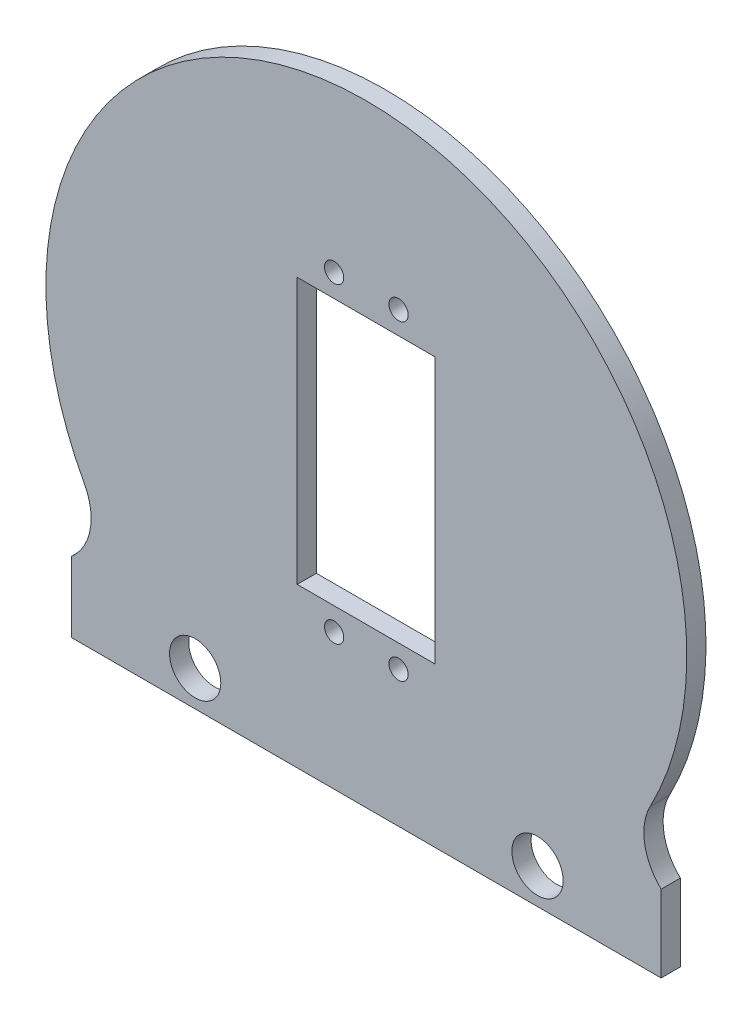
ISO-10303-21;
HEADER;
FILE_DESCRIPTION(('STEP AP214'),'2;1');
FILE_NAME('part.step','',(''),(''),'','','');
FILE_SCHEMA(('AUTOMOTIVE_DESIGN { 1 0 10303 214 1 1 1 1 }'));
ENDSEC;
DATA;
#1=APPLICATION_CONTEXT('core data for automotive mechanical design processes');
#2=APPLICATION_PROTOCOL_DEFINITION('international standard','automotive_design',2000,#1);
#3=PRODUCT_CONTEXT('',#1,'mechanical');
#4=PRODUCT('Part','Part','',(#3));
#5=PRODUCT_RELATED_PRODUCT_CATEGORY('part','',(#4));
#6=PRODUCT_DEFINITION_FORMATION('','',#4);
#7=PRODUCT_DEFINITION_CONTEXT('part definition',#1,'design');
#8=PRODUCT_DEFINITION('design','',#6,#7);
#9=PRODUCT_DEFINITION_SHAPE('','',#8);
#10=(LENGTH_UNIT() NAMED_UNIT(*) SI_UNIT(.MILLI.,.METRE.));
#11=(NAMED_UNIT(*) PLANE_ANGLE_UNIT() SI_UNIT($,.RADIAN.));
#12=(NAMED_UNIT(*) SI_UNIT($,.STERADIAN.) SOLID_ANGLE_UNIT());
#13=UNCERTAINTY_MEASURE_WITH_UNIT(LENGTH_MEASURE(1.E-05),#10,'distance_accuracy_value','');
#14=(GEOMETRIC_REPRESENTATION_CONTEXT(3) GLOBAL_UNCERTAINTY_ASSIGNED_CONTEXT((#13)) GLOBAL_UNIT_ASSIGNED_CONTEXT((#10,
#11,#12)) REPRESENTATION_CONTEXT('',''));
#15=CARTESIAN_POINT('',(0.,0.,0.));
#16=DIRECTION('',(0.,0.,1.));
#17=DIRECTION('',(1.,0.,0.));
#18=AXIS2_PLACEMENT_3D('',#15,#16,#17);
#19=CARTESIAN_POINT('',(52.025716267414,-27.2340343584031,3.));
#20=DIRECTION('',(0.,0.,1.));
#21=DIRECTION('',(1.,0.,0.));
#22=AXIS2_PLACEMENT_3D('',#19,#20,#21);
#23=PLANE('',#22);
#24=CARTESIAN_POINT('',(-26.7100000000002,-40.0437872606226,3.));
#25=DIRECTION('',(0.,0.,1.));
#26=DIRECTION('',(1.,0.,0.));
#27=AXIS2_PLACEMENT_3D('',#24,#25,#26);
#28=CIRCLE('',#27,4.);
#29=CARTESIAN_POINT('',(-22.7100000000002,-40.0437872606226,3.));
#30=VERTEX_POINT('',#29);
#31=EDGE_CURVE('E287',#30,#30,#28,.T.);
#32=ORIENTED_EDGE('',*,*,#31,.F.);
#33=EDGE_LOOP('',(#32));
#34=FACE_BOUND('',#33,.T.);
#35=CARTESIAN_POINT('',(-5.025,-24.3,3.));
#36=DIRECTION('',(0.,0.,1.));
#37=DIRECTION('',(-1.,0.,0.));
#38=AXIS2_PLACEMENT_3D('',#35,#36,#37);
#39=CIRCLE('',#38,1.5);
#40=CARTESIAN_POINT('',(-6.525,-24.3,3.));
#41=VERTEX_POINT('',#40);
#42=EDGE_CURVE('E299',#41,#41,#39,.T.);
#43=ORIENTED_EDGE('',*,*,#42,.F.);
#44=EDGE_LOOP('',(#43));
#45=FACE_BOUND('',#44,.T.);
#46=CARTESIAN_POINT('',(5.02499999999999,24.3,3.));
#47=DIRECTION('',(0.,0.,1.));
#48=DIRECTION('',(-1.,0.,0.));
#49=AXIS2_PLACEMENT_3D('',#46,#47,#48);
#50=CIRCLE('',#49,1.5);
#51=CARTESIAN_POINT('',(3.52499999999999,24.3,3.));
#52=VERTEX_POINT('',#51);
#53=EDGE_CURVE('E145',#52,#52,#50,.T.);
#54=ORIENTED_EDGE('',*,*,#53,.F.);
#55=EDGE_LOOP('',(#54));
#56=FACE_BOUND('',#55,.T.);
#57=DIRECTION('',(1.,0.,0.));
#58=VECTOR('',#57,1.);
#59=CARTESIAN_POINT('',(-46.,-45.5410196624969,3.));
#60=LINE('',#59,#58);
#61=CARTESIAN_POINT('',(-46.,-45.5410196624969,3.));
#62=VERTEX_POINT('',#61);
#63=CARTESIAN_POINT('',(46.,-45.5410196624969,3.));
#64=VERTEX_POINT('',#63);
#65=EDGE_CURVE('E155',#62,#64,#60,.T.);
#66=ORIENTED_EDGE('',*,*,#65,.T.);
#67=DIRECTION('',(0.,1.,0.));
#68=VECTOR('',#67,1.);
#69=CARTESIAN_POINT('',(46.,-33.5410196624969,3.));
#70=LINE('',#69,#68);
#71=CARTESIAN_POINT('',(46.,-33.5410196624969,3.));
#72=VERTEX_POINT('',#71);
#73=EDGE_CURVE('E158',#64,#72,#70,.T.);
#74=ORIENTED_EDGE('',*,*,#73,.T.);
#75=CARTESIAN_POINT('',(52.025716267414,-27.2340343584031,3.));
#76=DIRECTION('',(0.,0.,-1.));
#77=DIRECTION('',(1.,0.,0.));
#78=AXIS2_PLACEMENT_3D('',#75,#76,#77);
#79=CIRCLE('',#78,8.72280460410714);
#80=CARTESIAN_POINT('',(44.2977107600335,-23.1886356092896,3.));
#81=VERTEX_POINT('',#80);
#82=EDGE_CURVE('E161',#72,#81,#79,.T.);
#83=ORIENTED_EDGE('',*,*,#82,.T.);
#84=CARTESIAN_POINT('',(0.,0.,3.));
#85=DIRECTION('',(0.,0.,1.));
#86=DIRECTION('',(1.,0.,0.));
#87=AXIS2_PLACEMENT_3D('',#84,#85,#86);
#88=CIRCLE('',#87,50.);
#89=CARTESIAN_POINT('',(-43.9901379219059,-23.7669469139748,3.));
#90=VERTEX_POINT('',#89);
#91=EDGE_CURVE('E163',#81,#90,#88,.T.);
#92=ORIENTED_EDGE('',*,*,#91,.T.);
#93=CARTESIAN_POINT('',(-51.6644854739161,-27.9132355933105,3.));
#94=DIRECTION('',(0.,0.,-1.));
#95=DIRECTION('',(-1.,0.,0.));
#96=AXIS2_PLACEMENT_3D('',#93,#94,#95);
#97=CIRCLE('',#96,8.72280460410715);
#98=CARTESIAN_POINT('',(-46.,-34.5465548587482,3.));
#99=VERTEX_POINT('',#98);
#100=EDGE_CURVE('E165',#90,#99,#97,.T.);
#101=ORIENTED_EDGE('',*,*,#100,.T.);
#102=DIRECTION('',(0.,-1.,0.));
#103=VECTOR('',#102,1.);
#104=CARTESIAN_POINT('',(-46.,-34.5465548587482,3.));
#105=LINE('',#104,#103);
#106=EDGE_CURVE('E167',#99,#62,#105,.T.);
#107=ORIENTED_EDGE('',*,*,#106,.T.);
#108=EDGE_LOOP('',(#66,#74,#83,#92,#101,#107));
#109=FACE_BOUND('',#108,.T.);
#110=DIRECTION('',(-1.,0.,0.));
#111=VECTOR('',#110,1.);
#112=CARTESIAN_POINT('',(-10.7948280140151,20.75,3.));
#113=LINE('',#112,#111);
#114=CARTESIAN_POINT('',(10.7051719859849,20.75,3.));
#115=VERTEX_POINT('',#114);
#116=CARTESIAN_POINT('',(-10.7948280140151,20.75,3.));
#117=VERTEX_POINT('',#116);
#118=EDGE_CURVE('E124',#115,#117,#113,.T.);
#119=ORIENTED_EDGE('',*,*,#118,.F.);
#120=DIRECTION('',(0.,1.,0.));
#121=VECTOR('',#120,1.);
#122=CARTESIAN_POINT('',(10.7051719859849,20.75,3.));
#123=LINE('',#122,#121);
#124=CARTESIAN_POINT('',(10.7051719859849,-20.75,3.));
#125=VERTEX_POINT('',#124);
#126=EDGE_CURVE('E116',#125,#115,#123,.T.);
#127=ORIENTED_EDGE('',*,*,#126,.F.);
#128=DIRECTION('',(1.,0.,0.));
#129=VECTOR('',#128,1.);
#130=CARTESIAN_POINT('',(-10.7948280140151,-20.75,3.));
#131=LINE('',#130,#129);
#132=CARTESIAN_POINT('',(-10.7948280140151,-20.75,3.));
#133=VERTEX_POINT('',#132);
#134=EDGE_CURVE('E139',#133,#125,#131,.T.);
#135=ORIENTED_EDGE('',*,*,#134,.F.);
#136=DIRECTION('',(0.,-1.,0.));
#137=VECTOR('',#136,1.);
#138=CARTESIAN_POINT('',(-10.7948280140151,20.75,3.));
#139=LINE('',#138,#137);
#140=EDGE_CURVE('E137',#117,#133,#139,.T.);
#141=ORIENTED_EDGE('',*,*,#140,.F.);
#142=EDGE_LOOP('',(#119,#127,#135,#141));
#143=FACE_BOUND('',#142,.T.);
#144=CARTESIAN_POINT('',(5.025,-24.3,3.));
#145=DIRECTION('',(0.,0.,1.));
#146=DIRECTION('',(-1.,0.,0.));
#147=AXIS2_PLACEMENT_3D('',#144,#145,#146);
#148=CIRCLE('',#147,1.5);
#149=CARTESIAN_POINT('',(3.525,-24.3,3.));
#150=VERTEX_POINT('',#149);
#151=EDGE_CURVE('E305',#150,#150,#148,.T.);
#152=ORIENTED_EDGE('',*,*,#151,.F.);
#153=EDGE_LOOP('',(#152));
#154=FACE_BOUND('',#153,.T.);
#155=CARTESIAN_POINT('',(-5.02500000000001,24.3,3.));
#156=DIRECTION('',(0.,0.,1.));
#157=DIRECTION('',(-1.,0.,0.));
#158=AXIS2_PLACEMENT_3D('',#155,#156,#157);
#159=CIRCLE('',#158,1.5);
#160=CARTESIAN_POINT('',(-6.52500000000001,24.3,3.));
#161=VERTEX_POINT('',#160);
#162=EDGE_CURVE('E293',#161,#161,#159,.T.);
#163=ORIENTED_EDGE('',*,*,#162,.F.);
#164=EDGE_LOOP('',(#163));
#165=FACE_BOUND('',#164,.T.);
#166=CARTESIAN_POINT('',(26.7100000000002,-40.0437872606226,3.));
#167=DIRECTION('',(0.,0.,1.));
#168=DIRECTION('',(-1.,0.,0.));
#169=AXIS2_PLACEMENT_3D('',#166,#167,#168);
#170=CIRCLE('',#169,3.99999999999999);
#171=CARTESIAN_POINT('',(22.7100000000002,-40.0437872606226,3.));
#172=VERTEX_POINT('',#171);
#173=EDGE_CURVE('E278',#172,#172,#170,.T.);
#174=ORIENTED_EDGE('',*,*,#173,.F.);
#175=EDGE_LOOP('',(#174));
#176=FACE_BOUND('',#175,.T.);
#177=ADVANCED_FACE('F39',(#34,#45,#56,#109,#143,#154,#165,#176),#23,.T.);
#178=CARTESIAN_POINT('',(52.025716267414,-27.2340343584031,0.));
#179=DIRECTION('',(0.,0.,1.));
#180=DIRECTION('',(1.,0.,0.));
#181=AXIS2_PLACEMENT_3D('',#178,#179,#180);
#182=PLANE('',#181);
#183=DIRECTION('',(1.,0.,0.));
#184=VECTOR('',#183,1.);
#185=CARTESIAN_POINT('',(-46.,-45.5410196624969,0.));
#186=LINE('',#185,#184);
#187=CARTESIAN_POINT('',(-46.,-45.5410196624969,0.));
#188=VERTEX_POINT('',#187);
#189=CARTESIAN_POINT('',(46.,-45.5410196624969,0.));
#190=VERTEX_POINT('',#189);
#191=EDGE_CURVE('E132',#188,#190,#186,.T.);
#192=ORIENTED_EDGE('',*,*,#191,.F.);
#193=DIRECTION('',(0.,-1.,0.));
#194=VECTOR('',#193,1.);
#195=CARTESIAN_POINT('',(-46.,-34.5465548587482,0.));
#196=LINE('',#195,#194);
#197=CARTESIAN_POINT('',(-46.,-34.5465548587482,0.));
#198=VERTEX_POINT('',#197);
#199=EDGE_CURVE('E159',#198,#188,#196,.T.);
#200=ORIENTED_EDGE('',*,*,#199,.F.);
#201=CARTESIAN_POINT('',(-51.6644854739161,-27.9132355933105,0.));
#202=DIRECTION('',(0.,0.,-1.));
#203=DIRECTION('',(-1.,0.,0.));
#204=AXIS2_PLACEMENT_3D('',#201,#202,#203);
#205=CIRCLE('',#204,8.72280460410715);
#206=CARTESIAN_POINT('',(-43.9901379219059,-23.7669469139748,0.));
#207=VERTEX_POINT('',#206);
#208=EDGE_CURVE('E178',#207,#198,#205,.T.);
#209=ORIENTED_EDGE('',*,*,#208,.F.);
#210=CARTESIAN_POINT('',(0.,0.,0.));
#211=DIRECTION('',(0.,0.,1.));
#212=DIRECTION('',(1.,0.,0.));
#213=AXIS2_PLACEMENT_3D('',#210,#211,#212);
#214=CIRCLE('',#213,50.);
#215=CARTESIAN_POINT('',(44.2977107600335,-23.1886356092896,0.));
#216=VERTEX_POINT('',#215);
#217=EDGE_CURVE('E176',#216,#207,#214,.T.);
#218=ORIENTED_EDGE('',*,*,#217,.F.);
#219=CARTESIAN_POINT('',(52.025716267414,-27.2340343584031,0.));
#220=DIRECTION('',(0.,0.,-1.));
#221=DIRECTION('',(1.,0.,0.));
#222=AXIS2_PLACEMENT_3D('',#219,#220,#221);
#223=CIRCLE('',#222,8.72280460410714);
#224=CARTESIAN_POINT('',(46.,-33.5410196624969,0.));
#225=VERTEX_POINT('',#224);
#226=EDGE_CURVE('E174',#225,#216,#223,.T.);
#227=ORIENTED_EDGE('',*,*,#226,.F.);
#228=DIRECTION('',(0.,1.,0.));
#229=VECTOR('',#228,1.);
#230=CARTESIAN_POINT('',(46.,-33.5410196624969,0.));
#231=LINE('',#230,#229);
#232=EDGE_CURVE('E172',#190,#225,#231,.T.);
#233=ORIENTED_EDGE('',*,*,#232,.F.);
#234=EDGE_LOOP('',(#192,#200,#209,#218,#227,#233));
#235=FACE_BOUND('',#234,.T.);
#236=DIRECTION('',(0.,1.,0.));
#237=VECTOR('',#236,1.);
#238=CARTESIAN_POINT('',(10.7051719859849,20.75,0.));
#239=LINE('',#238,#237);
#240=CARTESIAN_POINT('',(10.7051719859849,-20.75,0.));
#241=VERTEX_POINT('',#240);
#242=CARTESIAN_POINT('',(10.7051719859849,20.75,0.));
#243=VERTEX_POINT('',#242);
#244=EDGE_CURVE('E62',#241,#243,#239,.T.);
#245=ORIENTED_EDGE('',*,*,#244,.T.);
#246=DIRECTION('',(-1.,0.,0.));
#247=VECTOR('',#246,1.);
#248=CARTESIAN_POINT('',(-10.7948280140151,20.75,0.));
#249=LINE('',#248,#247);
#250=CARTESIAN_POINT('',(-10.7948280140151,20.75,0.));
#251=VERTEX_POINT('',#250);
#252=EDGE_CURVE('E131',#243,#251,#249,.T.);
#253=ORIENTED_EDGE('',*,*,#252,.T.);
#254=DIRECTION('',(0.,-1.,0.));
#255=VECTOR('',#254,1.);
#256=CARTESIAN_POINT('',(-10.7948280140151,20.75,0.));
#257=LINE('',#256,#255);
#258=CARTESIAN_POINT('',(-10.7948280140151,-20.75,0.));
#259=VERTEX_POINT('',#258);
#260=EDGE_CURVE('E147',#251,#259,#257,.T.);
#261=ORIENTED_EDGE('',*,*,#260,.T.);
#262=DIRECTION('',(1.,0.,0.));
#263=VECTOR('',#262,1.);
#264=CARTESIAN_POINT('',(-10.7948280140151,-20.75,0.));
#265=LINE('',#264,#263);
#266=EDGE_CURVE('E125',#259,#241,#265,.T.);
#267=ORIENTED_EDGE('',*,*,#266,.T.);
#268=EDGE_LOOP('',(#245,#253,#261,#267));
#269=FACE_BOUND('',#268,.T.);
#270=CARTESIAN_POINT('',(5.02499999999999,24.3,0.));
#271=DIRECTION('',(0.,0.,1.));
#272=DIRECTION('',(-1.,0.,0.));
#273=AXIS2_PLACEMENT_3D('',#270,#271,#272);
#274=CIRCLE('',#273,1.5);
#275=CARTESIAN_POINT('',(3.52499999999999,24.3,0.));
#276=VERTEX_POINT('',#275);
#277=EDGE_CURVE('E308',#276,#276,#274,.T.);
#278=ORIENTED_EDGE('',*,*,#277,.T.);
#279=EDGE_LOOP('',(#278));
#280=FACE_BOUND('',#279,.T.);
#281=CARTESIAN_POINT('',(5.025,-24.3,0.));
#282=DIRECTION('',(0.,0.,1.));
#283=DIRECTION('',(-1.,0.,0.));
#284=AXIS2_PLACEMENT_3D('',#281,#282,#283);
#285=CIRCLE('',#284,1.5);
#286=CARTESIAN_POINT('',(3.525,-24.3,0.));
#287=VERTEX_POINT('',#286);
#288=EDGE_CURVE('E302',#287,#287,#285,.T.);
#289=ORIENTED_EDGE('',*,*,#288,.T.);
#290=EDGE_LOOP('',(#289));
#291=FACE_BOUND('',#290,.T.);
#292=CARTESIAN_POINT('',(-5.025,-24.3,0.));
#293=DIRECTION('',(0.,0.,1.));
#294=DIRECTION('',(-1.,0.,0.));
#295=AXIS2_PLACEMENT_3D('',#292,#293,#294);
#296=CIRCLE('',#295,1.5);
#297=CARTESIAN_POINT('',(-6.525,-24.3,0.));
#298=VERTEX_POINT('',#297);
#299=EDGE_CURVE('E296',#298,#298,#296,.T.);
#300=ORIENTED_EDGE('',*,*,#299,.T.);
#301=EDGE_LOOP('',(#300));
#302=FACE_BOUND('',#301,.T.);
#303=CARTESIAN_POINT('',(-5.02500000000001,24.3,0.));
#304=DIRECTION('',(0.,0.,1.));
#305=DIRECTION('',(-1.,0.,0.));
#306=AXIS2_PLACEMENT_3D('',#303,#304,#305);
#307=CIRCLE('',#306,1.5);
#308=CARTESIAN_POINT('',(-6.52500000000001,24.3,0.));
#309=VERTEX_POINT('',#308);
#310=EDGE_CURVE('E290',#309,#309,#307,.T.);
#311=ORIENTED_EDGE('',*,*,#310,.T.);
#312=EDGE_LOOP('',(#311));
#313=FACE_BOUND('',#312,.T.);
#314=CARTESIAN_POINT('',(-26.7100000000002,-40.0437872606226,0.));
#315=DIRECTION('',(0.,0.,1.));
#316=DIRECTION('',(1.,0.,0.));
#317=AXIS2_PLACEMENT_3D('',#314,#315,#316);
#318=CIRCLE('',#317,4.);
#319=CARTESIAN_POINT('',(-22.7100000000002,-40.0437872606226,0.));
#320=VERTEX_POINT('',#319);
#321=EDGE_CURVE('E284',#320,#320,#318,.T.);
#322=ORIENTED_EDGE('',*,*,#321,.T.);
#323=EDGE_LOOP('',(#322));
#324=FACE_BOUND('',#323,.T.);
#325=CARTESIAN_POINT('',(26.7100000000002,-40.0437872606226,0.));
#326=DIRECTION('',(0.,0.,1.));
#327=DIRECTION('',(-1.,0.,0.));
#328=AXIS2_PLACEMENT_3D('',#325,#326,#327);
#329=CIRCLE('',#328,3.99999999999999);
#330=CARTESIAN_POINT('',(22.7100000000002,-40.0437872606226,0.));
#331=VERTEX_POINT('',#330);
#332=EDGE_CURVE('E281',#331,#331,#329,.T.);
#333=ORIENTED_EDGE('',*,*,#332,.T.);
#334=EDGE_LOOP('',(#333));
#335=FACE_BOUND('',#334,.T.);
#336=ADVANCED_FACE('F202',(#235,#269,#280,#291,#302,#313,#324,#335),#182,.F.);
#337=CARTESIAN_POINT('',(-46.,-45.5410196624969,3.));
#338=DIRECTION('',(0.,1.,0.));
#339=DIRECTION('',(0.,0.,1.));
#340=AXIS2_PLACEMENT_3D('',#337,#338,#339);
#341=PLANE('',#340);
#342=ORIENTED_EDGE('',*,*,#191,.T.);
#343=DIRECTION('',(0.,0.,-1.));
#344=VECTOR('',#343,1.);
#345=CARTESIAN_POINT('',(46.,-45.5410196624969,3.));
#346=LINE('',#345,#344);
#347=EDGE_CURVE('E11',#64,#190,#346,.T.);
#348=ORIENTED_EDGE('',*,*,#347,.F.);
#349=ORIENTED_EDGE('',*,*,#65,.F.);
#350=DIRECTION('',(0.,0.,-1.));
#351=VECTOR('',#350,1.);
#352=CARTESIAN_POINT('',(-46.,-45.5410196624969,3.));
#353=LINE('',#352,#351);
#354=EDGE_CURVE('E169',#62,#188,#353,.T.);
#355=ORIENTED_EDGE('',*,*,#354,.T.);
#356=EDGE_LOOP('',(#342,#348,#349,#355));
#357=FACE_BOUND('',#356,.T.);
#358=ADVANCED_FACE('F41',(#357),#341,.F.);
#359=CARTESIAN_POINT('',(46.,-33.5410196624969,3.));
#360=DIRECTION('',(-1.,0.,0.));
#361=DIRECTION('',(0.,0.,1.));
#362=AXIS2_PLACEMENT_3D('',#359,#360,#361);
#363=PLANE('',#362);
#364=ORIENTED_EDGE('',*,*,#232,.T.);
#365=DIRECTION('',(0.,0.,-1.));
#366=VECTOR('',#365,1.);
#367=CARTESIAN_POINT('',(46.,-33.5410196624969,3.));
#368=LINE('',#367,#366);
#369=EDGE_CURVE('E47',#72,#225,#368,.T.);
#370=ORIENTED_EDGE('',*,*,#369,.F.);
#371=ORIENTED_EDGE('',*,*,#73,.F.);
#372=ORIENTED_EDGE('',*,*,#347,.T.);
#373=EDGE_LOOP('',(#364,#370,#371,#372));
#374=FACE_BOUND('',#373,.T.);
#375=ADVANCED_FACE('F219',(#374),#363,.F.);
#376=CARTESIAN_POINT('',(52.025716267414,-27.2340343584031,3.));
#377=DIRECTION('',(0.,0.,-1.));
#378=DIRECTION('',(-1.,0.,0.));
#379=AXIS2_PLACEMENT_3D('',#376,#377,#378);
#380=CYLINDRICAL_SURFACE('',#379,8.72280460410714);
#381=ORIENTED_EDGE('',*,*,#226,.T.);
#382=DIRECTION('',(0.,0.,-1.));
#383=VECTOR('',#382,1.);
#384=CARTESIAN_POINT('',(44.2977107600335,-23.1886356092896,3.));
#385=LINE('',#384,#383);
#386=EDGE_CURVE('E189',#81,#216,#385,.T.);
#387=ORIENTED_EDGE('',*,*,#386,.F.);
#388=ORIENTED_EDGE('',*,*,#82,.F.);
#389=ORIENTED_EDGE('',*,*,#369,.T.);
#390=EDGE_LOOP('',(#381,#387,#388,#389));
#391=FACE_BOUND('',#390,.T.);
#392=ADVANCED_FACE('F196',(#391),#380,.F.);
#393=CARTESIAN_POINT('',(0.,0.,3.));
#394=DIRECTION('',(0.,0.,-1.));
#395=DIRECTION('',(-1.,0.,0.));
#396=AXIS2_PLACEMENT_3D('',#393,#394,#395);
#397=CYLINDRICAL_SURFACE('',#396,50.);
#398=ORIENTED_EDGE('',*,*,#217,.T.);
#399=DIRECTION('',(0.,0.,-1.));
#400=VECTOR('',#399,1.);
#401=CARTESIAN_POINT('',(-43.9901379219059,-23.7669469139748,3.));
#402=LINE('',#401,#400);
#403=EDGE_CURVE('E186',#90,#207,#402,.T.);
#404=ORIENTED_EDGE('',*,*,#403,.F.);
#405=ORIENTED_EDGE('',*,*,#91,.F.);
#406=ORIENTED_EDGE('',*,*,#386,.T.);
#407=EDGE_LOOP('',(#398,#404,#405,#406));
#408=FACE_BOUND('',#407,.T.);
#409=ADVANCED_FACE('F208',(#408),#397,.T.);
#410=CARTESIAN_POINT('',(-51.6644854739161,-27.9132355933105,3.));
#411=DIRECTION('',(0.,0.,-1.));
#412=DIRECTION('',(-1.,0.,0.));
#413=AXIS2_PLACEMENT_3D('',#410,#411,#412);
#414=CYLINDRICAL_SURFACE('',#413,8.72280460410715);
#415=ORIENTED_EDGE('',*,*,#208,.T.);
#416=DIRECTION('',(0.,0.,-1.));
#417=VECTOR('',#416,1.);
#418=CARTESIAN_POINT('',(-46.,-34.5465548587482,3.));
#419=LINE('',#418,#417);
#420=EDGE_CURVE('E183',#99,#198,#419,.T.);
#421=ORIENTED_EDGE('',*,*,#420,.F.);
#422=ORIENTED_EDGE('',*,*,#100,.F.);
#423=ORIENTED_EDGE('',*,*,#403,.T.);
#424=EDGE_LOOP('',(#415,#421,#422,#423));
#425=FACE_BOUND('',#424,.T.);
#426=ADVANCED_FACE('F212',(#425),#414,.F.);
#427=CARTESIAN_POINT('',(-46.,-34.5465548587482,3.));
#428=DIRECTION('',(1.,0.,0.));
#429=DIRECTION('',(0.,0.,-1.));
#430=AXIS2_PLACEMENT_3D('',#427,#428,#429);
#431=PLANE('',#430);
#432=ORIENTED_EDGE('',*,*,#199,.T.);
#433=ORIENTED_EDGE('',*,*,#354,.F.);
#434=ORIENTED_EDGE('',*,*,#106,.F.);
#435=ORIENTED_EDGE('',*,*,#420,.T.);
#436=EDGE_LOOP('',(#432,#433,#434,#435));
#437=FACE_BOUND('',#436,.T.);
#438=ADVANCED_FACE('F222',(#437),#431,.F.);
#439=CARTESIAN_POINT('',(10.7051719859849,20.75,3.));
#440=DIRECTION('',(-1.,0.,0.));
#441=DIRECTION('',(0.,-1.,0.));
#442=AXIS2_PLACEMENT_3D('',#439,#440,#441);
#443=PLANE('',#442);
#444=ORIENTED_EDGE('',*,*,#244,.F.);
#445=DIRECTION('',(0.,0.,-1.));
#446=VECTOR('',#445,1.);
#447=CARTESIAN_POINT('',(10.7051719859849,-20.75,3.));
#448=LINE('',#447,#446);
#449=EDGE_CURVE('E120',#125,#241,#448,.T.);
#450=ORIENTED_EDGE('',*,*,#449,.F.);
#451=ORIENTED_EDGE('',*,*,#126,.T.);
#452=DIRECTION('',(0.,0.,-1.));
#453=VECTOR('',#452,1.);
#454=CARTESIAN_POINT('',(10.7051719859849,20.75,3.));
#455=LINE('',#454,#453);
#456=EDGE_CURVE('E119',#115,#243,#455,.T.);
#457=ORIENTED_EDGE('',*,*,#456,.T.);
#458=EDGE_LOOP('',(#444,#450,#451,#457));
#459=FACE_BOUND('',#458,.T.);
#460=ADVANCED_FACE('F118',(#459),#443,.T.);
#461=CARTESIAN_POINT('',(-10.7948280140151,20.75,3.));
#462=DIRECTION('',(0.,-1.,0.));
#463=DIRECTION('',(1.,0.,0.));
#464=AXIS2_PLACEMENT_3D('',#461,#462,#463);
#465=PLANE('',#464);
#466=ORIENTED_EDGE('',*,*,#252,.F.);
#467=ORIENTED_EDGE('',*,*,#456,.F.);
#468=ORIENTED_EDGE('',*,*,#118,.T.);
#469=DIRECTION('',(0.,0.,-1.));
#470=VECTOR('',#469,1.);
#471=CARTESIAN_POINT('',(-10.7948280140151,20.75,3.));
#472=LINE('',#471,#470);
#473=EDGE_CURVE('E133',#117,#251,#472,.T.);
#474=ORIENTED_EDGE('',*,*,#473,.T.);
#475=EDGE_LOOP('',(#466,#467,#468,#474));
#476=FACE_BOUND('',#475,.T.);
#477=ADVANCED_FACE('F128',(#476),#465,.T.);
#478=CARTESIAN_POINT('',(-10.7948280140151,20.75,3.));
#479=DIRECTION('',(1.,0.,0.));
#480=DIRECTION('',(0.,1.,0.));
#481=AXIS2_PLACEMENT_3D('',#478,#479,#480);
#482=PLANE('',#481);
#483=ORIENTED_EDGE('',*,*,#260,.F.);
#484=ORIENTED_EDGE('',*,*,#473,.F.);
#485=ORIENTED_EDGE('',*,*,#140,.T.);
#486=DIRECTION('',(0.,0.,-1.));
#487=VECTOR('',#486,1.);
#488=CARTESIAN_POINT('',(-10.7948280140151,-20.75,3.));
#489=LINE('',#488,#487);
#490=EDGE_CURVE('E54',#133,#259,#489,.T.);
#491=ORIENTED_EDGE('',*,*,#490,.T.);
#492=EDGE_LOOP('',(#483,#484,#485,#491));
#493=FACE_BOUND('',#492,.T.);
#494=ADVANCED_FACE('F243',(#493),#482,.T.);
#495=CARTESIAN_POINT('',(-10.7948280140151,-20.75,3.));
#496=DIRECTION('',(0.,1.,0.));
#497=DIRECTION('',(0.,0.,1.));
#498=AXIS2_PLACEMENT_3D('',#495,#496,#497);
#499=PLANE('',#498);
#500=ORIENTED_EDGE('',*,*,#266,.F.);
#501=ORIENTED_EDGE('',*,*,#490,.F.);
#502=ORIENTED_EDGE('',*,*,#134,.T.);
#503=ORIENTED_EDGE('',*,*,#449,.T.);
#504=EDGE_LOOP('',(#500,#501,#502,#503));
#505=FACE_BOUND('',#504,.T.);
#506=ADVANCED_FACE('F246',(#505),#499,.T.);
#507=CARTESIAN_POINT('',(5.02499999999999,24.3,3.));
#508=DIRECTION('',(0.,0.,-1.));
#509=DIRECTION('',(-1.,0.,0.));
#510=AXIS2_PLACEMENT_3D('',#507,#508,#509);
#511=CYLINDRICAL_SURFACE('',#510,1.5);
#512=ORIENTED_EDGE('',*,*,#53,.T.);
#513=EDGE_LOOP('',(#512));
#514=FACE_BOUND('',#513,.T.);
#515=ORIENTED_EDGE('',*,*,#277,.F.);
#516=EDGE_LOOP('',(#515));
#517=FACE_BOUND('',#516,.T.);
#518=ADVANCED_FACE('F250',(#514,#517),#511,.F.);
#519=CARTESIAN_POINT('',(5.025,-24.3,3.));
#520=DIRECTION('',(0.,0.,-1.));
#521=DIRECTION('',(-1.,0.,0.));
#522=AXIS2_PLACEMENT_3D('',#519,#520,#521);
#523=CYLINDRICAL_SURFACE('',#522,1.5);
#524=ORIENTED_EDGE('',*,*,#151,.T.);
#525=EDGE_LOOP('',(#524));
#526=FACE_BOUND('',#525,.T.);
#527=ORIENTED_EDGE('',*,*,#288,.F.);
#528=EDGE_LOOP('',(#527));
#529=FACE_BOUND('',#528,.T.);
#530=ADVANCED_FACE('F253',(#526,#529),#523,.F.);
#531=CARTESIAN_POINT('',(-5.025,-24.3,3.));
#532=DIRECTION('',(0.,0.,-1.));
#533=DIRECTION('',(-1.,0.,0.));
#534=AXIS2_PLACEMENT_3D('',#531,#532,#533);
#535=CYLINDRICAL_SURFACE('',#534,1.5);
#536=ORIENTED_EDGE('',*,*,#42,.T.);
#537=EDGE_LOOP('',(#536));
#538=FACE_BOUND('',#537,.T.);
#539=ORIENTED_EDGE('',*,*,#299,.F.);
#540=EDGE_LOOP('',(#539));
#541=FACE_BOUND('',#540,.T.);
#542=ADVANCED_FACE('F257',(#538,#541),#535,.F.);
#543=CARTESIAN_POINT('',(-5.02500000000001,24.3,3.));
#544=DIRECTION('',(0.,0.,-1.));
#545=DIRECTION('',(-1.,0.,0.));
#546=AXIS2_PLACEMENT_3D('',#543,#544,#545);
#547=CYLINDRICAL_SURFACE('',#546,1.5);
#548=ORIENTED_EDGE('',*,*,#162,.T.);
#549=EDGE_LOOP('',(#548));
#550=FACE_BOUND('',#549,.T.);
#551=ORIENTED_EDGE('',*,*,#310,.F.);
#552=EDGE_LOOP('',(#551));
#553=FACE_BOUND('',#552,.T.);
#554=ADVANCED_FACE('F261',(#550,#553),#547,.F.);
#555=CARTESIAN_POINT('',(-26.7100000000002,-40.0437872606226,3.));
#556=DIRECTION('',(0.,0.,-1.));
#557=DIRECTION('',(-1.,0.,0.));
#558=AXIS2_PLACEMENT_3D('',#555,#556,#557);
#559=CYLINDRICAL_SURFACE('',#558,4.);
#560=ORIENTED_EDGE('',*,*,#31,.T.);
#561=EDGE_LOOP('',(#560));
#562=FACE_BOUND('',#561,.T.);
#563=ORIENTED_EDGE('',*,*,#321,.F.);
#564=EDGE_LOOP('',(#563));
#565=FACE_BOUND('',#564,.T.);
#566=ADVANCED_FACE('F265',(#562,#565),#559,.F.);
#567=CARTESIAN_POINT('',(26.7100000000002,-40.0437872606226,3.));
#568=DIRECTION('',(0.,0.,-1.));
#569=DIRECTION('',(-1.,0.,0.));
#570=AXIS2_PLACEMENT_3D('',#567,#568,#569);
#571=CYLINDRICAL_SURFACE('',#570,3.99999999999999);
#572=ORIENTED_EDGE('',*,*,#173,.T.);
#573=EDGE_LOOP('',(#572));
#574=FACE_BOUND('',#573,.T.);
#575=ORIENTED_EDGE('',*,*,#332,.F.);
#576=EDGE_LOOP('',(#575));
#577=FACE_BOUND('',#576,.T.);
#578=ADVANCED_FACE('F269',(#574,#577),#571,.F.);
#579=CLOSED_SHELL('',(#177,#336,#358,#375,#392,#409,#426,#438,#460,#477,#494,#506,#518,#530,
#542,#554,#566,#578));
#580=MANIFOLD_SOLID_BREP('B2',#579);
#581=ADVANCED_BREP_SHAPE_REPRESENTATION('',(#18,#580),#14);
#582=SHAPE_DEFINITION_REPRESENTATION(#9,#581);
ENDSEC;
END-ISO-10303-21;
